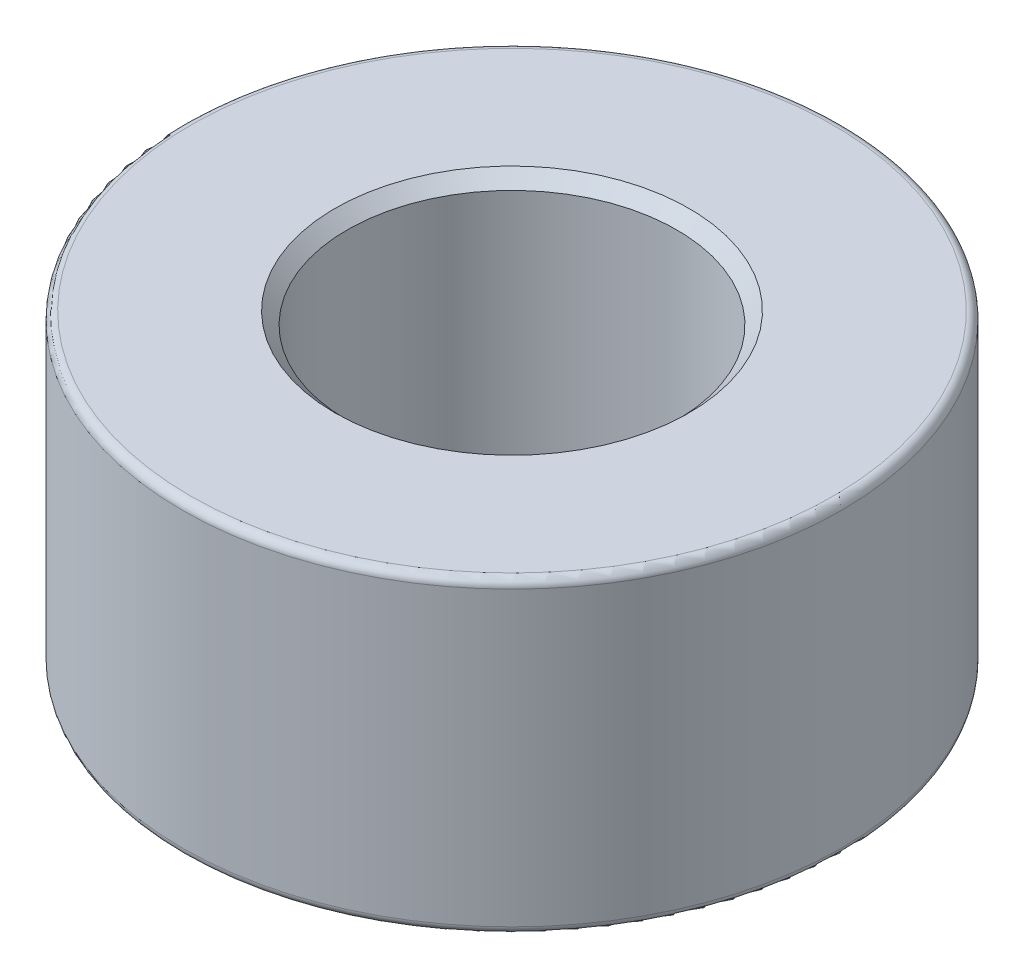
ISO-10303-21;
HEADER;
FILE_DESCRIPTION(('STEP AP214'),'2;1');
FILE_NAME('part.step','',(''),(''),'','','');
FILE_SCHEMA(('AUTOMOTIVE_DESIGN { 1 0 10303 214 1 1 1 1 }'));
ENDSEC;
DATA;
#1=APPLICATION_CONTEXT('core data for automotive mechanical design processes');
#2=APPLICATION_PROTOCOL_DEFINITION('international standard','automotive_design',2000,#1);
#3=PRODUCT_CONTEXT('',#1,'mechanical');
#4=PRODUCT('Part','Part','',(#3));
#5=PRODUCT_RELATED_PRODUCT_CATEGORY('part','',(#4));
#6=PRODUCT_DEFINITION_FORMATION('','',#4);
#7=PRODUCT_DEFINITION_CONTEXT('part definition',#1,'design');
#8=PRODUCT_DEFINITION('design','',#6,#7);
#9=PRODUCT_DEFINITION_SHAPE('','',#8);
#10=(LENGTH_UNIT() NAMED_UNIT(*) SI_UNIT(.MILLI.,.METRE.));
#11=(NAMED_UNIT(*) PLANE_ANGLE_UNIT() SI_UNIT($,.RADIAN.));
#12=(NAMED_UNIT(*) SI_UNIT($,.STERADIAN.) SOLID_ANGLE_UNIT());
#13=UNCERTAINTY_MEASURE_WITH_UNIT(LENGTH_MEASURE(1.E-05),#10,'distance_accuracy_value','');
#14=(GEOMETRIC_REPRESENTATION_CONTEXT(3) GLOBAL_UNCERTAINTY_ASSIGNED_CONTEXT((#13)) GLOBAL_UNIT_ASSIGNED_CONTEXT((#10,
#11,#12)) REPRESENTATION_CONTEXT('',''));
#15=CARTESIAN_POINT('',(0.,0.,0.));
#16=DIRECTION('',(0.,0.,1.));
#17=DIRECTION('',(1.,0.,0.));
#18=AXIS2_PLACEMENT_3D('',#15,#16,#17);
#19=CARTESIAN_POINT('',(0.,-1.875,0.));
#20=DIRECTION('',(0.,1.,0.));
#21=DIRECTION('',(0.,0.,1.));
#22=AXIS2_PLACEMENT_3D('',#19,#20,#21);
#23=CYLINDRICAL_SURFACE('',#22,4.);
#24=CARTESIAN_POINT('',(0.,1.775,0.));
#25=DIRECTION('',(0.,1.,0.));
#26=DIRECTION('',(0.,0.,1.));
#27=AXIS2_PLACEMENT_3D('',#24,#25,#26);
#28=CIRCLE('',#27,4.);
#29=CARTESIAN_POINT('',(0.,1.775,4.));
#30=VERTEX_POINT('',#29);
#31=EDGE_CURVE('E56',#30,#30,#28,.F.);
#32=ORIENTED_EDGE('',*,*,#31,.T.);
#33=EDGE_LOOP('',(#32));
#34=FACE_BOUND('',#33,.T.);
#35=CARTESIAN_POINT('',(0.,-1.775,0.));
#36=DIRECTION('',(0.,1.,0.));
#37=DIRECTION('',(0.,0.,1.));
#38=AXIS2_PLACEMENT_3D('',#35,#36,#37);
#39=CIRCLE('',#38,4.);
#40=CARTESIAN_POINT('',(0.,-1.775,4.));
#41=VERTEX_POINT('',#40);
#42=EDGE_CURVE('E59',#41,#41,#39,.T.);
#43=ORIENTED_EDGE('',*,*,#42,.T.);
#44=EDGE_LOOP('',(#43));
#45=FACE_BOUND('',#44,.T.);
#46=ADVANCED_FACE('F33',(#34,#45),#23,.T.);
#47=CARTESIAN_POINT('',(0.,-1.875,0.));
#48=DIRECTION('',(0.,1.,0.));
#49=DIRECTION('',(0.,0.,1.));
#50=AXIS2_PLACEMENT_3D('',#47,#48,#49);
#51=PLANE('',#50);
#52=CARTESIAN_POINT('',(0.,-1.875,0.));
#53=DIRECTION('',(0.,1.,0.));
#54=DIRECTION('',(0.,0.,1.));
#55=AXIS2_PLACEMENT_3D('',#52,#53,#54);
#56=CIRCLE('',#55,2.15);
#57=CARTESIAN_POINT('',(0.,-1.875,2.15));
#58=VERTEX_POINT('',#57);
#59=EDGE_CURVE('E48',#58,#58,#56,.T.);
#60=ORIENTED_EDGE('',*,*,#59,.T.);
#61=EDGE_LOOP('',(#60));
#62=FACE_BOUND('',#61,.T.);
#63=CARTESIAN_POINT('',(0.,-1.875,0.));
#64=DIRECTION('',(0.,1.,0.));
#65=DIRECTION('',(0.,0.,1.));
#66=AXIS2_PLACEMENT_3D('',#63,#64,#65);
#67=CIRCLE('',#66,3.9);
#68=CARTESIAN_POINT('',(0.,-1.875,3.9));
#69=VERTEX_POINT('',#68);
#70=EDGE_CURVE('E53',#69,#69,#67,.F.);
#71=ORIENTED_EDGE('',*,*,#70,.T.);
#72=EDGE_LOOP('',(#71));
#73=FACE_BOUND('',#72,.T.);
#74=ADVANCED_FACE('F85',(#62,#73),#51,.F.);
#75=CARTESIAN_POINT('',(0.,-1.875,0.));
#76=DIRECTION('',(0.,1.,0.));
#77=DIRECTION('',(0.,0.,1.));
#78=AXIS2_PLACEMENT_3D('',#75,#76,#77);
#79=CYLINDRICAL_SURFACE('',#78,2.);
#80=CARTESIAN_POINT('',(0.,-1.725,0.));
#81=DIRECTION('',(0.,1.,0.));
#82=DIRECTION('',(0.,0.,1.));
#83=AXIS2_PLACEMENT_3D('',#80,#81,#82);
#84=CIRCLE('',#83,2.);
#85=CARTESIAN_POINT('',(0.,-1.725,2.));
#86=VERTEX_POINT('',#85);
#87=EDGE_CURVE('E40',#86,#86,#84,.F.);
#88=ORIENTED_EDGE('',*,*,#87,.T.);
#89=EDGE_LOOP('',(#88));
#90=FACE_BOUND('',#89,.T.);
#91=CARTESIAN_POINT('',(0.,1.725,0.));
#92=DIRECTION('',(0.,1.,0.));
#93=DIRECTION('',(0.,0.,1.));
#94=AXIS2_PLACEMENT_3D('',#91,#92,#93);
#95=CIRCLE('',#94,2.);
#96=CARTESIAN_POINT('',(0.,1.725,2.));
#97=VERTEX_POINT('',#96);
#98=EDGE_CURVE('E44',#97,#97,#95,.T.);
#99=ORIENTED_EDGE('',*,*,#98,.T.);
#100=EDGE_LOOP('',(#99));
#101=FACE_BOUND('',#100,.T.);
#102=ADVANCED_FACE('F80',(#90,#101),#79,.F.);
#103=CARTESIAN_POINT('',(0.,1.875,0.));
#104=DIRECTION('',(0.,1.,0.));
#105=DIRECTION('',(0.,0.,1.));
#106=AXIS2_PLACEMENT_3D('',#103,#104,#105);
#107=PLANE('',#106);
#108=CARTESIAN_POINT('',(0.,1.875,0.));
#109=DIRECTION('',(0.,1.,0.));
#110=DIRECTION('',(0.,0.,1.));
#111=AXIS2_PLACEMENT_3D('',#108,#109,#110);
#112=CIRCLE('',#111,2.15);
#113=CARTESIAN_POINT('',(0.,1.875,2.15));
#114=VERTEX_POINT('',#113);
#115=EDGE_CURVE('E10',#114,#114,#112,.F.);
#116=ORIENTED_EDGE('',*,*,#115,.T.);
#117=EDGE_LOOP('',(#116));
#118=FACE_BOUND('',#117,.T.);
#119=CARTESIAN_POINT('',(0.,1.875,0.));
#120=DIRECTION('',(0.,1.,0.));
#121=DIRECTION('',(0.,0.,1.));
#122=AXIS2_PLACEMENT_3D('',#119,#120,#121);
#123=CIRCLE('',#122,3.9);
#124=CARTESIAN_POINT('',(0.,1.875,3.9));
#125=VERTEX_POINT('',#124);
#126=EDGE_CURVE('E62',#125,#125,#123,.T.);
#127=ORIENTED_EDGE('',*,*,#126,.T.);
#128=EDGE_LOOP('',(#127));
#129=FACE_BOUND('',#128,.T.);
#130=ADVANCED_FACE('F66',(#118,#129),#107,.T.);
#131=CARTESIAN_POINT('',(0.,1.775,0.));
#132=DIRECTION('',(0.,1.,0.));
#133=DIRECTION('',(0.,0.,1.));
#134=AXIS2_PLACEMENT_3D('',#131,#132,#133);
#135=TOROIDAL_SURFACE('',#134,3.9,0.1);
#136=ORIENTED_EDGE('',*,*,#31,.F.);
#137=EDGE_LOOP('',(#136));
#138=FACE_BOUND('',#137,.T.);
#139=ORIENTED_EDGE('',*,*,#126,.F.);
#140=EDGE_LOOP('',(#139));
#141=FACE_BOUND('',#140,.T.);
#142=ADVANCED_FACE('F68',(#138,#141),#135,.T.);
#143=CARTESIAN_POINT('',(0.,-1.775,0.));
#144=DIRECTION('',(0.,1.,0.));
#145=DIRECTION('',(0.,0.,1.));
#146=AXIS2_PLACEMENT_3D('',#143,#144,#145);
#147=TOROIDAL_SURFACE('',#146,3.9,0.1);
#148=ORIENTED_EDGE('',*,*,#70,.F.);
#149=EDGE_LOOP('',(#148));
#150=FACE_BOUND('',#149,.T.);
#151=ORIENTED_EDGE('',*,*,#42,.F.);
#152=EDGE_LOOP('',(#151));
#153=FACE_BOUND('',#152,.T.);
#154=ADVANCED_FACE('F70',(#150,#153),#147,.T.);
#155=CARTESIAN_POINT('',(0.,-1.875,0.));
#156=DIRECTION('',(0.,-1.,0.));
#157=DIRECTION('',(0.,0.,-1.));
#158=AXIS2_PLACEMENT_3D('',#155,#156,#157);
#159=CONICAL_SURFACE('',#158,2.15,0.785398163397448);
#160=ORIENTED_EDGE('',*,*,#87,.F.);
#161=EDGE_LOOP('',(#160));
#162=FACE_BOUND('',#161,.T.);
#163=ORIENTED_EDGE('',*,*,#59,.F.);
#164=EDGE_LOOP('',(#163));
#165=FACE_BOUND('',#164,.T.);
#166=ADVANCED_FACE('F77',(#162,#165),#159,.F.);
#167=CARTESIAN_POINT('',(0.,1.725,0.));
#168=DIRECTION('',(0.,1.,0.));
#169=DIRECTION('',(0.,0.,1.));
#170=AXIS2_PLACEMENT_3D('',#167,#168,#169);
#171=CONICAL_SURFACE('',#170,2.,0.785398163397451);
#172=ORIENTED_EDGE('',*,*,#115,.F.);
#173=EDGE_LOOP('',(#172));
#174=FACE_BOUND('',#173,.T.);
#175=ORIENTED_EDGE('',*,*,#98,.F.);
#176=EDGE_LOOP('',(#175));
#177=FACE_BOUND('',#176,.T.);
#178=ADVANCED_FACE('F35',(#174,#177),#171,.F.);
#179=CLOSED_SHELL('',(#46,#74,#102,#130,#142,#154,#166,#178));
#180=MANIFOLD_SOLID_BREP('B2',#179);
#181=ADVANCED_BREP_SHAPE_REPRESENTATION('',(#18,#180),#14);
#182=SHAPE_DEFINITION_REPRESENTATION(#9,#181);
ENDSEC;
END-ISO-10303-21;
